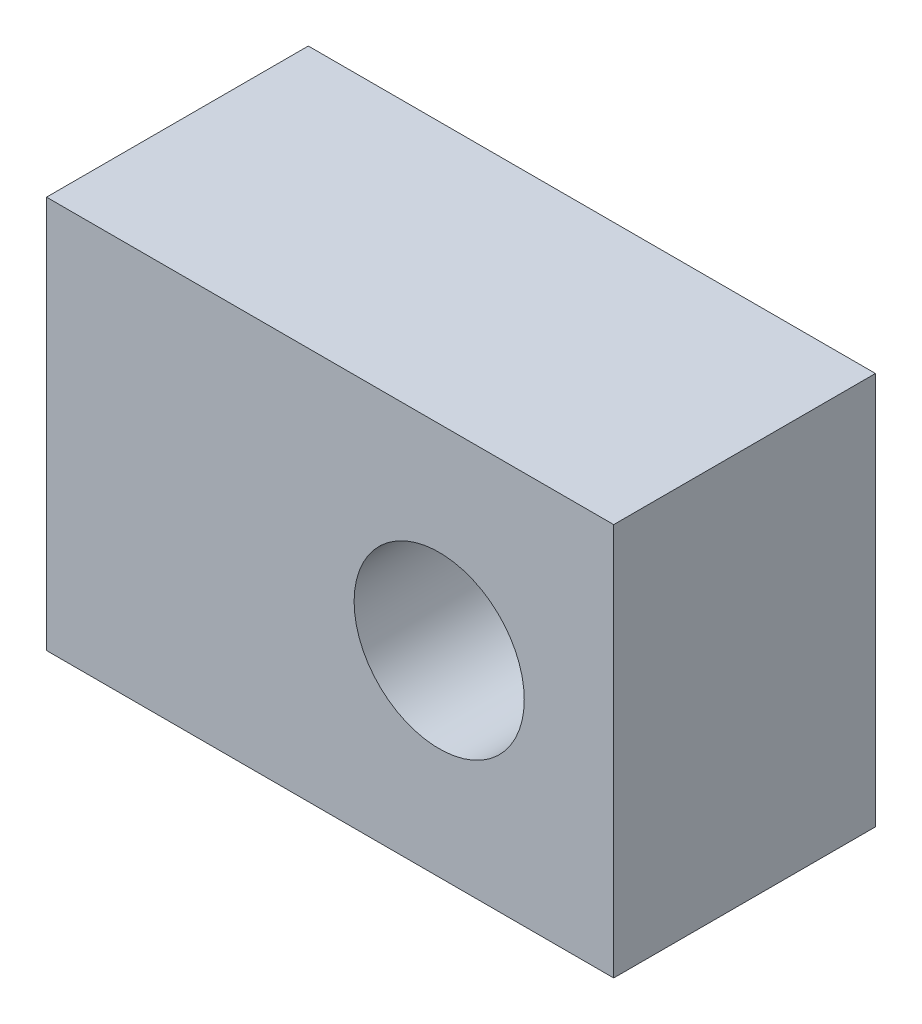
ISO-10303-21;
HEADER;
FILE_DESCRIPTION(('STEP AP214'),'2;1');
FILE_NAME('part.step','',(''),(''),'','','');
FILE_SCHEMA(('AUTOMOTIVE_DESIGN { 1 0 10303 214 1 1 1 1 }'));
ENDSEC;
DATA;
#1=APPLICATION_CONTEXT('core data for automotive mechanical design processes');
#2=APPLICATION_PROTOCOL_DEFINITION('international standard','automotive_design',2000,#1);
#3=PRODUCT_CONTEXT('',#1,'mechanical');
#4=PRODUCT('Part','Part','',(#3));
#5=PRODUCT_RELATED_PRODUCT_CATEGORY('part','',(#4));
#6=PRODUCT_DEFINITION_FORMATION('','',#4);
#7=PRODUCT_DEFINITION_CONTEXT('part definition',#1,'design');
#8=PRODUCT_DEFINITION('design','',#6,#7);
#9=PRODUCT_DEFINITION_SHAPE('','',#8);
#10=(LENGTH_UNIT() NAMED_UNIT(*) SI_UNIT(.MILLI.,.METRE.));
#11=(NAMED_UNIT(*) PLANE_ANGLE_UNIT() SI_UNIT($,.RADIAN.));
#12=(NAMED_UNIT(*) SI_UNIT($,.STERADIAN.) SOLID_ANGLE_UNIT());
#13=UNCERTAINTY_MEASURE_WITH_UNIT(LENGTH_MEASURE(1.E-05),#10,'distance_accuracy_value','');
#14=(GEOMETRIC_REPRESENTATION_CONTEXT(3) GLOBAL_UNCERTAINTY_ASSIGNED_CONTEXT((#13)) GLOBAL_UNIT_ASSIGNED_CONTEXT((#10,
#11,#12)) REPRESENTATION_CONTEXT('',''));
#15=CARTESIAN_POINT('',(0.,0.,0.));
#16=DIRECTION('',(0.,0.,1.));
#17=DIRECTION('',(1.,0.,0.));
#18=AXIS2_PLACEMENT_3D('',#15,#16,#17);
#19=CARTESIAN_POINT('',(14.845632514959,8.82334762681522,6.));
#20=DIRECTION('',(-1.,0.,0.));
#21=DIRECTION('',(0.,1.,0.));
#22=AXIS2_PLACEMENT_3D('',#19,#20,#21);
#23=PLANE('',#22);
#24=DIRECTION('',(0.,-1.,0.));
#25=VECTOR('',#24,1.);
#26=CARTESIAN_POINT('',(14.845632514959,8.82334762681522,0.));
#27=LINE('',#26,#25);
#28=CARTESIAN_POINT('',(14.845632514959,8.82334762681522,0.));
#29=VERTEX_POINT('',#28);
#30=CARTESIAN_POINT('',(14.845632514959,-0.176652373184779,0.));
#31=VERTEX_POINT('',#30);
#32=EDGE_CURVE('E98',#29,#31,#27,.T.);
#33=ORIENTED_EDGE('',*,*,#32,.F.);
#34=DIRECTION('',(0.,0.,-1.));
#35=VECTOR('',#34,1.);
#36=CARTESIAN_POINT('',(14.845632514959,8.82334762681522,6.));
#37=LINE('',#36,#35);
#38=CARTESIAN_POINT('',(14.845632514959,8.82334762681522,6.));
#39=VERTEX_POINT('',#38);
#40=EDGE_CURVE('E97',#39,#29,#37,.T.);
#41=ORIENTED_EDGE('',*,*,#40,.F.);
#42=DIRECTION('',(0.,-1.,0.));
#43=VECTOR('',#42,1.);
#44=CARTESIAN_POINT('',(14.845632514959,8.82334762681522,6.));
#45=LINE('',#44,#43);
#46=CARTESIAN_POINT('',(14.845632514959,-0.176652373184779,6.));
#47=VERTEX_POINT('',#46);
#48=EDGE_CURVE('E91',#39,#47,#45,.T.);
#49=ORIENTED_EDGE('',*,*,#48,.T.);
#50=DIRECTION('',(0.,0.,-1.));
#51=VECTOR('',#50,1.);
#52=CARTESIAN_POINT('',(14.845632514959,-0.176652373184779,6.));
#53=LINE('',#52,#51);
#54=EDGE_CURVE('E11',#47,#31,#53,.T.);
#55=ORIENTED_EDGE('',*,*,#54,.T.);
#56=EDGE_LOOP('',(#33,#41,#49,#55));
#57=FACE_BOUND('',#56,.T.);
#58=ADVANCED_FACE('F32',(#57),#23,.F.);
#59=CARTESIAN_POINT('',(14.845632514959,-0.176652373184779,6.));
#60=DIRECTION('',(0.,1.,0.));
#61=DIRECTION('',(0.,0.,1.));
#62=AXIS2_PLACEMENT_3D('',#59,#60,#61);
#63=PLANE('',#62);
#64=DIRECTION('',(-1.,0.,0.));
#65=VECTOR('',#64,1.);
#66=CARTESIAN_POINT('',(14.845632514959,-0.176652373184779,0.));
#67=LINE('',#66,#65);
#68=CARTESIAN_POINT('',(1.84563251495896,-0.176652373184779,0.));
#69=VERTEX_POINT('',#68);
#70=EDGE_CURVE('E100',#31,#69,#67,.T.);
#71=ORIENTED_EDGE('',*,*,#70,.F.);
#72=ORIENTED_EDGE('',*,*,#54,.F.);
#73=DIRECTION('',(-1.,0.,0.));
#74=VECTOR('',#73,1.);
#75=CARTESIAN_POINT('',(14.845632514959,-0.176652373184779,6.));
#76=LINE('',#75,#74);
#77=CARTESIAN_POINT('',(1.84563251495896,-0.176652373184779,6.));
#78=VERTEX_POINT('',#77);
#79=EDGE_CURVE('E74',#47,#78,#76,.T.);
#80=ORIENTED_EDGE('',*,*,#79,.T.);
#81=DIRECTION('',(0.,0.,-1.));
#82=VECTOR('',#81,1.);
#83=CARTESIAN_POINT('',(1.84563251495896,-0.176652373184779,6.));
#84=LINE('',#83,#82);
#85=EDGE_CURVE('E41',#78,#69,#84,.T.);
#86=ORIENTED_EDGE('',*,*,#85,.T.);
#87=EDGE_LOOP('',(#71,#72,#80,#86));
#88=FACE_BOUND('',#87,.T.);
#89=ADVANCED_FACE('F89',(#88),#63,.F.);
#90=CARTESIAN_POINT('',(1.84563251495896,8.82334762681522,6.));
#91=DIRECTION('',(1.,0.,0.));
#92=DIRECTION('',(0.,-1.,0.));
#93=AXIS2_PLACEMENT_3D('',#90,#91,#92);
#94=PLANE('',#93);
#95=DIRECTION('',(0.,1.,0.));
#96=VECTOR('',#95,1.);
#97=CARTESIAN_POINT('',(1.84563251495896,8.82334762681522,0.));
#98=LINE('',#97,#96);
#99=CARTESIAN_POINT('',(1.84563251495896,8.82334762681522,0.));
#100=VERTEX_POINT('',#99);
#101=EDGE_CURVE('E84',#69,#100,#98,.T.);
#102=ORIENTED_EDGE('',*,*,#101,.F.);
#103=ORIENTED_EDGE('',*,*,#85,.F.);
#104=DIRECTION('',(0.,1.,0.));
#105=VECTOR('',#104,1.);
#106=CARTESIAN_POINT('',(1.84563251495896,8.82334762681522,6.));
#107=LINE('',#106,#105);
#108=CARTESIAN_POINT('',(1.84563251495896,8.82334762681522,6.));
#109=VERTEX_POINT('',#108);
#110=EDGE_CURVE('E77',#78,#109,#107,.T.);
#111=ORIENTED_EDGE('',*,*,#110,.T.);
#112=DIRECTION('',(0.,0.,-1.));
#113=VECTOR('',#112,1.);
#114=CARTESIAN_POINT('',(1.84563251495896,8.82334762681522,6.));
#115=LINE('',#114,#113);
#116=EDGE_CURVE('E87',#109,#100,#115,.T.);
#117=ORIENTED_EDGE('',*,*,#116,.T.);
#118=EDGE_LOOP('',(#102,#103,#111,#117));
#119=FACE_BOUND('',#118,.T.);
#120=ADVANCED_FACE('F83',(#119),#94,.F.);
#121=CARTESIAN_POINT('',(14.845632514959,8.82334762681522,6.));
#122=DIRECTION('',(0.,-1.,0.));
#123=DIRECTION('',(0.,0.,-1.));
#124=AXIS2_PLACEMENT_3D('',#121,#122,#123);
#125=PLANE('',#124);
#126=DIRECTION('',(1.,0.,0.));
#127=VECTOR('',#126,1.);
#128=CARTESIAN_POINT('',(14.845632514959,8.82334762681522,0.));
#129=LINE('',#128,#127);
#130=EDGE_CURVE('E63',#100,#29,#129,.T.);
#131=ORIENTED_EDGE('',*,*,#130,.F.);
#132=ORIENTED_EDGE('',*,*,#116,.F.);
#133=DIRECTION('',(1.,0.,0.));
#134=VECTOR('',#133,1.);
#135=CARTESIAN_POINT('',(14.845632514959,8.82334762681522,6.));
#136=LINE('',#135,#134);
#137=EDGE_CURVE('E49',#109,#39,#136,.T.);
#138=ORIENTED_EDGE('',*,*,#137,.T.);
#139=ORIENTED_EDGE('',*,*,#40,.T.);
#140=EDGE_LOOP('',(#131,#132,#138,#139));
#141=FACE_BOUND('',#140,.T.);
#142=ADVANCED_FACE('F109',(#141),#125,.F.);
#143=CARTESIAN_POINT('',(14.845632514959,-0.176652373184779,6.));
#144=DIRECTION('',(0.,0.,1.));
#145=DIRECTION('',(-1.,0.,0.));
#146=AXIS2_PLACEMENT_3D('',#143,#144,#145);
#147=PLANE('',#146);
#148=CARTESIAN_POINT('',(10.845632514959,4.32334762681522,6.));
#149=DIRECTION('',(0.,0.,-1.));
#150=DIRECTION('',(-1.,0.,0.));
#151=AXIS2_PLACEMENT_3D('',#148,#149,#150);
#152=CIRCLE('',#151,1.95);
#153=CARTESIAN_POINT('',(8.89563251495896,4.32334762681522,6.));
#154=VERTEX_POINT('',#153);
#155=EDGE_CURVE('E165',#154,#154,#152,.T.);
#156=ORIENTED_EDGE('',*,*,#155,.T.);
#157=EDGE_LOOP('',(#156));
#158=FACE_BOUND('',#157,.T.);
#159=ORIENTED_EDGE('',*,*,#48,.F.);
#160=ORIENTED_EDGE('',*,*,#137,.F.);
#161=ORIENTED_EDGE('',*,*,#110,.F.);
#162=ORIENTED_EDGE('',*,*,#79,.F.);
#163=EDGE_LOOP('',(#159,#160,#161,#162));
#164=FACE_BOUND('',#163,.T.);
#165=ADVANCED_FACE('F79',(#158,#164),#147,.T.);
#166=CARTESIAN_POINT('',(14.845632514959,-0.176652373184779,0.));
#167=DIRECTION('',(0.,0.,1.));
#168=DIRECTION('',(-1.,0.,0.));
#169=AXIS2_PLACEMENT_3D('',#166,#167,#168);
#170=PLANE('',#169);
#171=CARTESIAN_POINT('',(10.845632514959,4.32334762681522,0.));
#172=DIRECTION('',(0.,0.,-1.));
#173=DIRECTION('',(-1.,0.,0.));
#174=AXIS2_PLACEMENT_3D('',#171,#172,#173);
#175=CIRCLE('',#174,1.95);
#176=CARTESIAN_POINT('',(8.89563251495896,4.32334762681522,0.));
#177=VERTEX_POINT('',#176);
#178=EDGE_CURVE('E35',#177,#177,#175,.T.);
#179=ORIENTED_EDGE('',*,*,#178,.F.);
#180=EDGE_LOOP('',(#179));
#181=FACE_BOUND('',#180,.T.);
#182=ORIENTED_EDGE('',*,*,#32,.T.);
#183=ORIENTED_EDGE('',*,*,#70,.T.);
#184=ORIENTED_EDGE('',*,*,#101,.T.);
#185=ORIENTED_EDGE('',*,*,#130,.T.);
#186=EDGE_LOOP('',(#182,#183,#184,#185));
#187=FACE_BOUND('',#186,.T.);
#188=ADVANCED_FACE('F105',(#181,#187),#170,.F.);
#189=CARTESIAN_POINT('',(10.845632514959,4.32334762681522,-10.));
#190=DIRECTION('',(0.,0.,1.));
#191=DIRECTION('',(-1.,0.,0.));
#192=AXIS2_PLACEMENT_3D('',#189,#190,#191);
#193=CYLINDRICAL_SURFACE('',#192,1.95);
#194=ORIENTED_EDGE('',*,*,#155,.F.);
#195=EDGE_LOOP('',(#194));
#196=FACE_BOUND('',#195,.T.);
#197=ORIENTED_EDGE('',*,*,#178,.T.);
#198=EDGE_LOOP('',(#197));
#199=FACE_BOUND('',#198,.T.);
#200=ADVANCED_FACE('F149',(#196,#199),#193,.F.);
#201=CLOSED_SHELL('',(#58,#89,#120,#142,#165,#188,#200));
#202=MANIFOLD_SOLID_BREP('B2',#201);
#203=ADVANCED_BREP_SHAPE_REPRESENTATION('',(#18,#202),#14);
#204=SHAPE_DEFINITION_REPRESENTATION(#9,#203);
ENDSEC;
END-ISO-10303-21;
